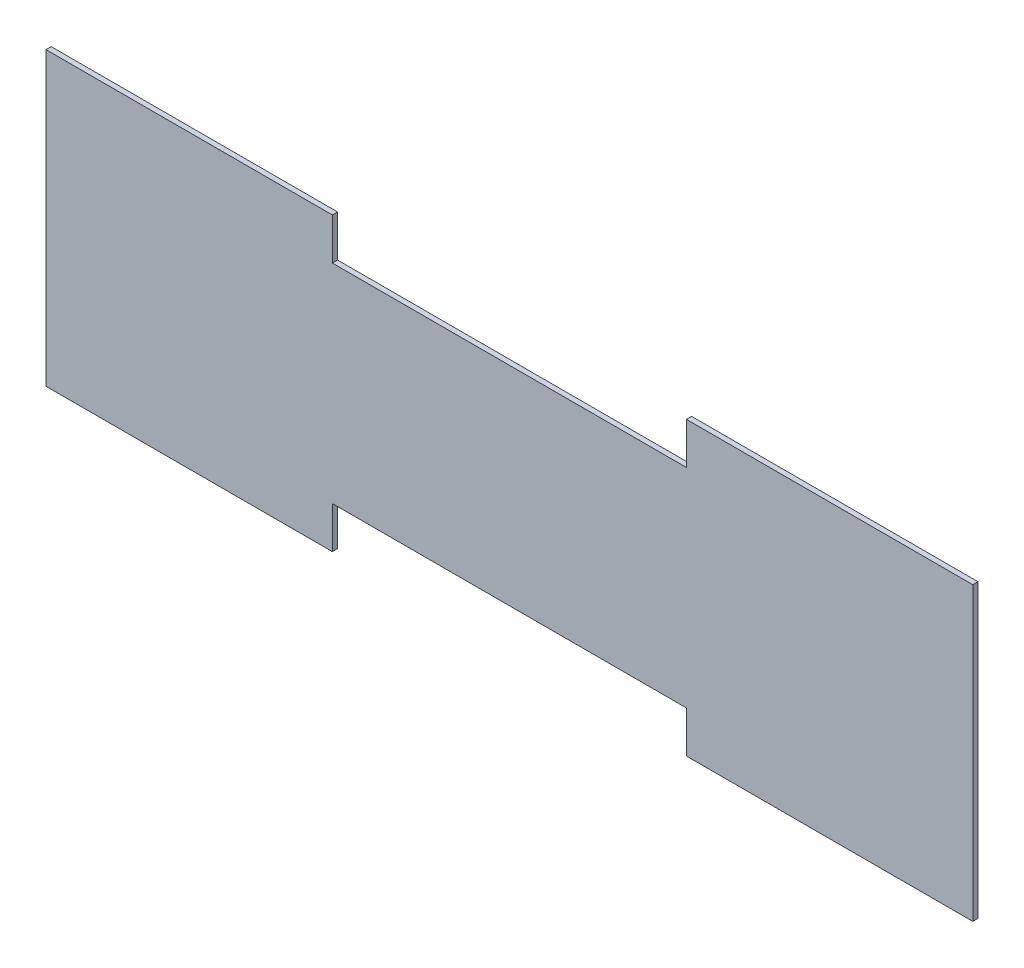
ISO-10303-21;
HEADER;
FILE_DESCRIPTION(('STEP AP214'),'2;1');
FILE_NAME('part.step','',(''),(''),'','','');
FILE_SCHEMA(('AUTOMOTIVE_DESIGN { 1 0 10303 214 1 1 1 1 }'));
ENDSEC;
DATA;
#1=APPLICATION_CONTEXT('core data for automotive mechanical design processes');
#2=APPLICATION_PROTOCOL_DEFINITION('international standard','automotive_design',2000,#1);
#3=PRODUCT_CONTEXT('',#1,'mechanical');
#4=PRODUCT('Part','Part','',(#3));
#5=PRODUCT_RELATED_PRODUCT_CATEGORY('part','',(#4));
#6=PRODUCT_DEFINITION_FORMATION('','',#4);
#7=PRODUCT_DEFINITION_CONTEXT('part definition',#1,'design');
#8=PRODUCT_DEFINITION('design','',#6,#7);
#9=PRODUCT_DEFINITION_SHAPE('','',#8);
#10=(LENGTH_UNIT() NAMED_UNIT(*) SI_UNIT(.MILLI.,.METRE.));
#11=(NAMED_UNIT(*) PLANE_ANGLE_UNIT() SI_UNIT($,.RADIAN.));
#12=(NAMED_UNIT(*) SI_UNIT($,.STERADIAN.) SOLID_ANGLE_UNIT());
#13=UNCERTAINTY_MEASURE_WITH_UNIT(LENGTH_MEASURE(1.E-05),#10,'distance_accuracy_value','');
#14=(GEOMETRIC_REPRESENTATION_CONTEXT(3) GLOBAL_UNCERTAINTY_ASSIGNED_CONTEXT((#13)) GLOBAL_UNIT_ASSIGNED_CONTEXT((#10,
#11,#12)) REPRESENTATION_CONTEXT('',''));
#15=CARTESIAN_POINT('',(0.,0.,0.));
#16=DIRECTION('',(0.,0.,1.));
#17=DIRECTION('',(1.,0.,0.));
#18=AXIS2_PLACEMENT_3D('',#15,#16,#17);
#19=CARTESIAN_POINT('',(37.364573133741,141.830889990023,136.606137608752));
#20=DIRECTION('',(0.,0.,1.));
#21=DIRECTION('',(1.,0.,0.));
#22=AXIS2_PLACEMENT_3D('',#19,#20,#21);
#23=PLANE('',#22);
#24=DIRECTION('',(1.,0.,0.));
#25=VECTOR('',#24,1.);
#26=CARTESIAN_POINT('',(37.3645731337411,-35.9691100099769,136.606137608752));
#27=LINE('',#26,#25);
#28=CARTESIAN_POINT('',(-546.835426866259,-35.9691100099767,136.606137608752));
#29=VERTEX_POINT('',#28);
#30=CARTESIAN_POINT('',(-197.585426866259,-35.9691100099769,136.606137608752));
#31=VERTEX_POINT('',#30);
#32=EDGE_CURVE('E157',#29,#31,#27,.T.);
#33=ORIENTED_EDGE('',*,*,#32,.T.);
#34=DIRECTION('',(0.,1.,0.));
#35=VECTOR('',#34,1.);
#36=CARTESIAN_POINT('',(-197.585426866259,140.557395031935,136.606137608752));
#37=LINE('',#36,#35);
#38=CARTESIAN_POINT('',(-197.585426866259,14.830889990023,136.606137608752));
#39=VERTEX_POINT('',#38);
#40=EDGE_CURVE('E162',#31,#39,#37,.T.);
#41=ORIENTED_EDGE('',*,*,#40,.T.);
#42=DIRECTION('',(-1.,0.,0.));
#43=VECTOR('',#42,1.);
#44=CARTESIAN_POINT('',(13.5520731337411,14.8308899900231,136.606137608752));
#45=LINE('',#44,#43);
#46=CARTESIAN_POINT('',(234.214573133741,14.8308899900231,136.606137608752));
#47=VERTEX_POINT('',#46);
#48=EDGE_CURVE('E108',#39,#47,#45,.F.);
#49=ORIENTED_EDGE('',*,*,#48,.T.);
#50=DIRECTION('',(0.,1.,0.));
#51=VECTOR('',#50,1.);
#52=CARTESIAN_POINT('',(234.214573133741,140.557395031935,136.606137608752));
#53=LINE('',#52,#51);
#54=CARTESIAN_POINT('',(234.214573133741,-35.9691100099769,136.606137608752));
#55=VERTEX_POINT('',#54);
#56=EDGE_CURVE('E17',#47,#55,#53,.F.);
#57=ORIENTED_EDGE('',*,*,#56,.T.);
#58=DIRECTION('',(1.,0.,0.));
#59=VECTOR('',#58,1.);
#60=CARTESIAN_POINT('',(37.3645731337411,-35.9691100099769,136.606137608752));
#61=LINE('',#60,#59);
#62=CARTESIAN_POINT('',(583.464573133741,-35.9691100099769,136.606137608752));
#63=VERTEX_POINT('',#62);
#64=EDGE_CURVE('E106',#55,#63,#61,.T.);
#65=ORIENTED_EDGE('',*,*,#64,.T.);
#66=DIRECTION('',(0.,1.,0.));
#67=VECTOR('',#66,1.);
#68=CARTESIAN_POINT('',(583.464573133741,140.557395031935,136.606137608752));
#69=LINE('',#68,#67);
#70=CARTESIAN_POINT('',(583.464573133741,319.630889990023,136.606137608752));
#71=VERTEX_POINT('',#70);
#72=EDGE_CURVE('E100',#71,#63,#69,.F.);
#73=ORIENTED_EDGE('',*,*,#72,.F.);
#74=DIRECTION('',(1.,0.,0.));
#75=VECTOR('',#74,1.);
#76=CARTESIAN_POINT('',(428.487256169319,319.630889990023,136.606137608752));
#77=LINE('',#76,#75);
#78=CARTESIAN_POINT('',(234.214573133741,319.630889990023,136.606137608752));
#79=VERTEX_POINT('',#78);
#80=EDGE_CURVE('E126',#79,#71,#77,.T.);
#81=ORIENTED_EDGE('',*,*,#80,.F.);
#82=DIRECTION('',(0.,1.,0.));
#83=VECTOR('',#82,1.);
#84=CARTESIAN_POINT('',(234.214573133741,140.557395031935,136.606137608752));
#85=LINE('',#84,#83);
#86=CARTESIAN_POINT('',(234.214573133741,268.830889990023,136.606137608752));
#87=VERTEX_POINT('',#86);
#88=EDGE_CURVE('E133',#79,#87,#85,.F.);
#89=ORIENTED_EDGE('',*,*,#88,.T.);
#90=DIRECTION('',(1.,0.,0.));
#91=VECTOR('',#90,1.);
#92=CARTESIAN_POINT('',(621.564573133741,268.830889990023,136.606137608752));
#93=LINE('',#92,#91);
#94=CARTESIAN_POINT('',(-197.585426866259,268.830889990023,136.606137608752));
#95=VERTEX_POINT('',#94);
#96=EDGE_CURVE('E138',#87,#95,#93,.F.);
#97=ORIENTED_EDGE('',*,*,#96,.T.);
#98=DIRECTION('',(0.,1.,0.));
#99=VECTOR('',#98,1.);
#100=CARTESIAN_POINT('',(-197.585426866259,140.557395031935,136.606137608752));
#101=LINE('',#100,#99);
#102=CARTESIAN_POINT('',(-197.585426866259,319.630889990023,136.606137608752));
#103=VERTEX_POINT('',#102);
#104=EDGE_CURVE('E143',#95,#103,#101,.T.);
#105=ORIENTED_EDGE('',*,*,#104,.T.);
#106=DIRECTION('',(1.,0.,0.));
#107=VECTOR('',#106,1.);
#108=CARTESIAN_POINT('',(-372.210426866259,319.630889990023,136.606137608752));
#109=LINE('',#108,#107);
#110=CARTESIAN_POINT('',(-546.835426866259,319.630889990023,136.606137608752));
#111=VERTEX_POINT('',#110);
#112=EDGE_CURVE('E146',#111,#103,#109,.T.);
#113=ORIENTED_EDGE('',*,*,#112,.F.);
#114=DIRECTION('',(0.,1.,0.));
#115=VECTOR('',#114,1.);
#116=CARTESIAN_POINT('',(-546.835426866259,140.557395031935,136.606137608752));
#117=LINE('',#116,#115);
#118=EDGE_CURVE('E150',#29,#111,#117,.T.);
#119=ORIENTED_EDGE('',*,*,#118,.F.);
#120=EDGE_LOOP('',(#33,#41,#49,#57,#65,#73,#81,#89,#97,#105,#113,#119));
#121=FACE_BOUND('',#120,.T.);
#122=ADVANCED_FACE('F14',(#121),#23,.T.);
#123=CARTESIAN_POINT('',(234.214573133741,140.557395031935,136.606137608752));
#124=DIRECTION('',(1.,0.,0.));
#125=DIRECTION('',(0.,1.,0.));
#126=AXIS2_PLACEMENT_3D('',#123,#124,#125);
#127=PLANE('',#126);
#128=DIRECTION('',(0.,0.,1.));
#129=VECTOR('',#128,1.);
#130=CARTESIAN_POINT('',(234.214573133741,-35.9691100099769,136.606137608752));
#131=LINE('',#130,#129);
#132=CARTESIAN_POINT('',(234.214573133741,-35.9691100099769,130.256137608752));
#133=VERTEX_POINT('',#132);
#134=EDGE_CURVE('E113',#133,#55,#131,.T.);
#135=ORIENTED_EDGE('',*,*,#134,.T.);
#136=ORIENTED_EDGE('',*,*,#56,.F.);
#137=DIRECTION('',(0.,0.,1.));
#138=VECTOR('',#137,1.);
#139=CARTESIAN_POINT('',(234.214573133741,14.8308899900231,136.606137608752));
#140=LINE('',#139,#138);
#141=CARTESIAN_POINT('',(234.214573133741,14.8308899900231,130.256137608752));
#142=VERTEX_POINT('',#141);
#143=EDGE_CURVE('E166',#47,#142,#140,.F.);
#144=ORIENTED_EDGE('',*,*,#143,.T.);
#145=DIRECTION('',(0.,1.,0.));
#146=VECTOR('',#145,1.);
#147=CARTESIAN_POINT('',(234.214573133741,141.830889990023,130.256137608752));
#148=LINE('',#147,#146);
#149=EDGE_CURVE('E122',#142,#133,#148,.F.);
#150=ORIENTED_EDGE('',*,*,#149,.T.);
#151=EDGE_LOOP('',(#135,#136,#144,#150));
#152=FACE_BOUND('',#151,.T.);
#153=ADVANCED_FACE('F121',(#152),#127,.F.);
#154=CARTESIAN_POINT('',(37.3645731337411,-35.9691100099769,136.606137608752));
#155=DIRECTION('',(0.,1.,0.));
#156=DIRECTION('',(0.,0.,1.));
#157=AXIS2_PLACEMENT_3D('',#154,#155,#156);
#158=PLANE('',#157);
#159=DIRECTION('',(0.,0.,1.));
#160=VECTOR('',#159,1.);
#161=CARTESIAN_POINT('',(583.464573133741,-35.9691100099769,136.606137608752));
#162=LINE('',#161,#160);
#163=CARTESIAN_POINT('',(583.464573133741,-35.9691100099769,130.256137608752));
#164=VERTEX_POINT('',#163);
#165=EDGE_CURVE('E118',#63,#164,#162,.F.);
#166=ORIENTED_EDGE('',*,*,#165,.F.);
#167=ORIENTED_EDGE('',*,*,#64,.F.);
#168=ORIENTED_EDGE('',*,*,#134,.F.);
#169=DIRECTION('',(1.,0.,0.));
#170=VECTOR('',#169,1.);
#171=CARTESIAN_POINT('',(37.364573133741,-35.9691100099769,130.256137608752));
#172=LINE('',#171,#170);
#173=EDGE_CURVE('E169',#133,#164,#172,.T.);
#174=ORIENTED_EDGE('',*,*,#173,.T.);
#175=EDGE_LOOP('',(#166,#167,#168,#174));
#176=FACE_BOUND('',#175,.T.);
#177=ADVANCED_FACE('F115',(#176),#158,.F.);
#178=CARTESIAN_POINT('',(583.464573133741,140.557395031935,136.606137608752));
#179=DIRECTION('',(1.,0.,0.));
#180=DIRECTION('',(0.,1.,0.));
#181=AXIS2_PLACEMENT_3D('',#178,#179,#180);
#182=PLANE('',#181);
#183=ORIENTED_EDGE('',*,*,#72,.T.);
#184=ORIENTED_EDGE('',*,*,#165,.T.);
#185=DIRECTION('',(0.,1.,0.));
#186=VECTOR('',#185,1.);
#187=CARTESIAN_POINT('',(583.464573133741,141.830889990023,130.256137608752));
#188=LINE('',#187,#186);
#189=CARTESIAN_POINT('',(583.464573133741,319.630889990023,130.256137608752));
#190=VERTEX_POINT('',#189);
#191=EDGE_CURVE('E171',#164,#190,#188,.T.);
#192=ORIENTED_EDGE('',*,*,#191,.T.);
#193=DIRECTION('',(0.,0.,1.));
#194=VECTOR('',#193,1.);
#195=CARTESIAN_POINT('',(583.464573133741,319.630889990023,136.606137608752));
#196=LINE('',#195,#194);
#197=EDGE_CURVE('E128',#71,#190,#196,.F.);
#198=ORIENTED_EDGE('',*,*,#197,.F.);
#199=EDGE_LOOP('',(#183,#184,#192,#198));
#200=FACE_BOUND('',#199,.T.);
#201=ADVANCED_FACE('F231',(#200),#182,.T.);
#202=CARTESIAN_POINT('',(428.487256169319,319.630889990023,136.606137608752));
#203=DIRECTION('',(0.,1.,0.));
#204=DIRECTION('',(0.,0.,1.));
#205=AXIS2_PLACEMENT_3D('',#202,#203,#204);
#206=PLANE('',#205);
#207=ORIENTED_EDGE('',*,*,#80,.T.);
#208=ORIENTED_EDGE('',*,*,#197,.T.);
#209=DIRECTION('',(1.,0.,0.));
#210=VECTOR('',#209,1.);
#211=CARTESIAN_POINT('',(37.364573133741,319.630889990023,130.256137608752));
#212=LINE('',#211,#210);
#213=CARTESIAN_POINT('',(234.214573133741,319.630889990023,130.256137608752));
#214=VERTEX_POINT('',#213);
#215=EDGE_CURVE('E174',#190,#214,#212,.F.);
#216=ORIENTED_EDGE('',*,*,#215,.T.);
#217=DIRECTION('',(0.,0.,1.));
#218=VECTOR('',#217,1.);
#219=CARTESIAN_POINT('',(234.214573133741,319.630889990023,136.606137608752));
#220=LINE('',#219,#218);
#221=EDGE_CURVE('E130',#214,#79,#220,.T.);
#222=ORIENTED_EDGE('',*,*,#221,.T.);
#223=EDGE_LOOP('',(#207,#208,#216,#222));
#224=FACE_BOUND('',#223,.T.);
#225=ADVANCED_FACE('F230',(#224),#206,.T.);
#226=CARTESIAN_POINT('',(234.214573133741,140.557395031935,136.606137608752));
#227=DIRECTION('',(1.,0.,0.));
#228=DIRECTION('',(0.,1.,0.));
#229=AXIS2_PLACEMENT_3D('',#226,#227,#228);
#230=PLANE('',#229);
#231=DIRECTION('',(0.,0.,1.));
#232=VECTOR('',#231,1.);
#233=CARTESIAN_POINT('',(234.214573133741,268.830889990023,136.606137608752));
#234=LINE('',#233,#232);
#235=CARTESIAN_POINT('',(234.214573133741,268.830889990023,130.256137608752));
#236=VERTEX_POINT('',#235);
#237=EDGE_CURVE('E135',#236,#87,#234,.T.);
#238=ORIENTED_EDGE('',*,*,#237,.T.);
#239=ORIENTED_EDGE('',*,*,#88,.F.);
#240=ORIENTED_EDGE('',*,*,#221,.F.);
#241=DIRECTION('',(0.,1.,0.));
#242=VECTOR('',#241,1.);
#243=CARTESIAN_POINT('',(234.214573133741,141.830889990023,130.256137608752));
#244=LINE('',#243,#242);
#245=EDGE_CURVE('E177',#214,#236,#244,.F.);
#246=ORIENTED_EDGE('',*,*,#245,.T.);
#247=EDGE_LOOP('',(#238,#239,#240,#246));
#248=FACE_BOUND('',#247,.T.);
#249=ADVANCED_FACE('F226',(#248),#230,.F.);
#250=CARTESIAN_POINT('',(621.564573133741,268.830889990023,136.606137608752));
#251=DIRECTION('',(0.,-1.,0.));
#252=DIRECTION('',(1.,0.,0.));
#253=AXIS2_PLACEMENT_3D('',#250,#251,#252);
#254=PLANE('',#253);
#255=DIRECTION('',(0.,0.,1.));
#256=VECTOR('',#255,1.);
#257=CARTESIAN_POINT('',(-197.585426866259,268.830889990023,136.606137608752));
#258=LINE('',#257,#256);
#259=CARTESIAN_POINT('',(-197.585426866259,268.830889990023,130.256137608752));
#260=VERTEX_POINT('',#259);
#261=EDGE_CURVE('E140',#260,#95,#258,.T.);
#262=ORIENTED_EDGE('',*,*,#261,.T.);
#263=ORIENTED_EDGE('',*,*,#96,.F.);
#264=ORIENTED_EDGE('',*,*,#237,.F.);
#265=DIRECTION('',(1.,0.,0.));
#266=VECTOR('',#265,1.);
#267=CARTESIAN_POINT('',(37.364573133741,268.830889990023,130.256137608752));
#268=LINE('',#267,#266);
#269=EDGE_CURVE('E180',#236,#260,#268,.F.);
#270=ORIENTED_EDGE('',*,*,#269,.T.);
#271=EDGE_LOOP('',(#262,#263,#264,#270));
#272=FACE_BOUND('',#271,.T.);
#273=ADVANCED_FACE('F222',(#272),#254,.F.);
#274=CARTESIAN_POINT('',(-197.585426866259,140.557395031935,136.606137608752));
#275=DIRECTION('',(-1.,0.,0.));
#276=DIRECTION('',(0.,0.,1.));
#277=AXIS2_PLACEMENT_3D('',#274,#275,#276);
#278=PLANE('',#277);
#279=DIRECTION('',(0.,0.,1.));
#280=VECTOR('',#279,1.);
#281=CARTESIAN_POINT('',(-197.585426866259,319.630889990023,136.606137608752));
#282=LINE('',#281,#280);
#283=CARTESIAN_POINT('',(-197.585426866259,319.630889990023,130.256137608752));
#284=VERTEX_POINT('',#283);
#285=EDGE_CURVE('E148',#103,#284,#282,.F.);
#286=ORIENTED_EDGE('',*,*,#285,.F.);
#287=ORIENTED_EDGE('',*,*,#104,.F.);
#288=ORIENTED_EDGE('',*,*,#261,.F.);
#289=DIRECTION('',(0.,1.,0.));
#290=VECTOR('',#289,1.);
#291=CARTESIAN_POINT('',(-197.585426866259,141.830889990023,130.256137608752));
#292=LINE('',#291,#290);
#293=EDGE_CURVE('E183',#260,#284,#292,.T.);
#294=ORIENTED_EDGE('',*,*,#293,.T.);
#295=EDGE_LOOP('',(#286,#287,#288,#294));
#296=FACE_BOUND('',#295,.T.);
#297=ADVANCED_FACE('F218',(#296),#278,.F.);
#298=CARTESIAN_POINT('',(-372.210426866259,319.630889990023,136.606137608752));
#299=DIRECTION('',(0.,1.,0.));
#300=DIRECTION('',(0.,0.,1.));
#301=AXIS2_PLACEMENT_3D('',#298,#299,#300);
#302=PLANE('',#301);
#303=ORIENTED_EDGE('',*,*,#112,.T.);
#304=ORIENTED_EDGE('',*,*,#285,.T.);
#305=DIRECTION('',(1.,0.,0.));
#306=VECTOR('',#305,1.);
#307=CARTESIAN_POINT('',(37.364573133741,319.630889990023,130.256137608752));
#308=LINE('',#307,#306);
#309=CARTESIAN_POINT('',(-546.835426866259,319.630889990023,130.256137608752));
#310=VERTEX_POINT('',#309);
#311=EDGE_CURVE('E186',#284,#310,#308,.F.);
#312=ORIENTED_EDGE('',*,*,#311,.T.);
#313=DIRECTION('',(0.,0.,1.));
#314=VECTOR('',#313,1.);
#315=CARTESIAN_POINT('',(-546.835426866259,319.630889990023,136.606137608752));
#316=LINE('',#315,#314);
#317=EDGE_CURVE('E152',#111,#310,#316,.F.);
#318=ORIENTED_EDGE('',*,*,#317,.F.);
#319=EDGE_LOOP('',(#303,#304,#312,#318));
#320=FACE_BOUND('',#319,.T.);
#321=ADVANCED_FACE('F214',(#320),#302,.T.);
#322=CARTESIAN_POINT('',(-546.835426866259,140.557395031935,136.606137608752));
#323=DIRECTION('',(-1.,0.,0.));
#324=DIRECTION('',(0.,0.,1.));
#325=AXIS2_PLACEMENT_3D('',#322,#323,#324);
#326=PLANE('',#325);
#327=ORIENTED_EDGE('',*,*,#118,.T.);
#328=ORIENTED_EDGE('',*,*,#317,.T.);
#329=DIRECTION('',(0.,1.,0.));
#330=VECTOR('',#329,1.);
#331=CARTESIAN_POINT('',(-546.835426866259,141.830889990023,130.256137608752));
#332=LINE('',#331,#330);
#333=CARTESIAN_POINT('',(-546.835426866259,-35.9691100099767,130.256137608752));
#334=VERTEX_POINT('',#333);
#335=EDGE_CURVE('E189',#310,#334,#332,.F.);
#336=ORIENTED_EDGE('',*,*,#335,.T.);
#337=DIRECTION('',(0.,0.,1.));
#338=VECTOR('',#337,1.);
#339=CARTESIAN_POINT('',(-546.835426866259,-35.9691100099769,136.606137608752));
#340=LINE('',#339,#338);
#341=EDGE_CURVE('E154',#334,#29,#340,.T.);
#342=ORIENTED_EDGE('',*,*,#341,.T.);
#343=EDGE_LOOP('',(#327,#328,#336,#342));
#344=FACE_BOUND('',#343,.T.);
#345=ADVANCED_FACE('F208',(#344),#326,.T.);
#346=CARTESIAN_POINT('',(37.3645731337411,-35.9691100099769,136.606137608752));
#347=DIRECTION('',(0.,1.,0.));
#348=DIRECTION('',(0.,0.,1.));
#349=AXIS2_PLACEMENT_3D('',#346,#347,#348);
#350=PLANE('',#349);
#351=DIRECTION('',(0.,0.,1.));
#352=VECTOR('',#351,1.);
#353=CARTESIAN_POINT('',(-197.585426866259,-35.9691100099769,136.606137608752));
#354=LINE('',#353,#352);
#355=CARTESIAN_POINT('',(-197.585426866259,-35.9691100099769,130.256137608752));
#356=VERTEX_POINT('',#355);
#357=EDGE_CURVE('E159',#356,#31,#354,.T.);
#358=ORIENTED_EDGE('',*,*,#357,.T.);
#359=ORIENTED_EDGE('',*,*,#32,.F.);
#360=ORIENTED_EDGE('',*,*,#341,.F.);
#361=DIRECTION('',(1.,0.,0.));
#362=VECTOR('',#361,1.);
#363=CARTESIAN_POINT('',(37.364573133741,-35.9691100099767,130.256137608752));
#364=LINE('',#363,#362);
#365=EDGE_CURVE('E192',#334,#356,#364,.T.);
#366=ORIENTED_EDGE('',*,*,#365,.T.);
#367=EDGE_LOOP('',(#358,#359,#360,#366));
#368=FACE_BOUND('',#367,.T.);
#369=ADVANCED_FACE('F205',(#368),#350,.F.);
#370=CARTESIAN_POINT('',(-197.585426866259,140.557395031935,136.606137608752));
#371=DIRECTION('',(-1.,0.,0.));
#372=DIRECTION('',(0.,0.,1.));
#373=AXIS2_PLACEMENT_3D('',#370,#371,#372);
#374=PLANE('',#373);
#375=DIRECTION('',(0.,0.,1.));
#376=VECTOR('',#375,1.);
#377=CARTESIAN_POINT('',(-197.585426866259,14.8308899900231,136.606137608752));
#378=LINE('',#377,#376);
#379=CARTESIAN_POINT('',(-197.585426866259,14.830889990023,130.256137608752));
#380=VERTEX_POINT('',#379);
#381=EDGE_CURVE('E31',#380,#39,#378,.T.);
#382=ORIENTED_EDGE('',*,*,#381,.T.);
#383=ORIENTED_EDGE('',*,*,#40,.F.);
#384=ORIENTED_EDGE('',*,*,#357,.F.);
#385=DIRECTION('',(0.,1.,0.));
#386=VECTOR('',#385,1.);
#387=CARTESIAN_POINT('',(-197.585426866259,141.830889990023,130.256137608752));
#388=LINE('',#387,#386);
#389=EDGE_CURVE('E23',#356,#380,#388,.T.);
#390=ORIENTED_EDGE('',*,*,#389,.T.);
#391=EDGE_LOOP('',(#382,#383,#384,#390));
#392=FACE_BOUND('',#391,.T.);
#393=ADVANCED_FACE('F198',(#392),#374,.F.);
#394=CARTESIAN_POINT('',(13.5520731337411,14.8308899900231,136.606137608752));
#395=DIRECTION('',(0.,1.,0.));
#396=DIRECTION('',(-1.,0.,0.));
#397=AXIS2_PLACEMENT_3D('',#394,#395,#396);
#398=PLANE('',#397);
#399=ORIENTED_EDGE('',*,*,#143,.F.);
#400=ORIENTED_EDGE('',*,*,#48,.F.);
#401=ORIENTED_EDGE('',*,*,#381,.F.);
#402=DIRECTION('',(1.,0.,0.));
#403=VECTOR('',#402,1.);
#404=CARTESIAN_POINT('',(37.364573133741,14.830889990023,130.256137608752));
#405=LINE('',#404,#403);
#406=EDGE_CURVE('E9',#380,#142,#405,.T.);
#407=ORIENTED_EDGE('',*,*,#406,.T.);
#408=EDGE_LOOP('',(#399,#400,#401,#407));
#409=FACE_BOUND('',#408,.T.);
#410=ADVANCED_FACE('F232',(#409),#398,.F.);
#411=CARTESIAN_POINT('',(37.364573133741,141.830889990023,130.256137608752));
#412=DIRECTION('',(0.,0.,1.));
#413=DIRECTION('',(1.,0.,0.));
#414=AXIS2_PLACEMENT_3D('',#411,#412,#413);
#415=PLANE('',#414);
#416=ORIENTED_EDGE('',*,*,#389,.F.);
#417=ORIENTED_EDGE('',*,*,#365,.F.);
#418=ORIENTED_EDGE('',*,*,#335,.F.);
#419=ORIENTED_EDGE('',*,*,#311,.F.);
#420=ORIENTED_EDGE('',*,*,#293,.F.);
#421=ORIENTED_EDGE('',*,*,#269,.F.);
#422=ORIENTED_EDGE('',*,*,#245,.F.);
#423=ORIENTED_EDGE('',*,*,#215,.F.);
#424=ORIENTED_EDGE('',*,*,#191,.F.);
#425=ORIENTED_EDGE('',*,*,#173,.F.);
#426=ORIENTED_EDGE('',*,*,#149,.F.);
#427=ORIENTED_EDGE('',*,*,#406,.F.);
#428=EDGE_LOOP('',(#416,#417,#418,#419,#420,#421,#422,#423,#424,#425,#426,#427));
#429=FACE_BOUND('',#428,.T.);
#430=ADVANCED_FACE('F202',(#429),#415,.F.);
#431=CLOSED_SHELL('',(#122,#153,#177,#201,#225,#249,#273,#297,#321,#345,#369,#393,#410,#430));
#432=MANIFOLD_SOLID_BREP('B1',#431);
#433=ADVANCED_BREP_SHAPE_REPRESENTATION('',(#18,#432),#14);
#434=SHAPE_DEFINITION_REPRESENTATION(#9,#433);
ENDSEC;
END-ISO-10303-21;
